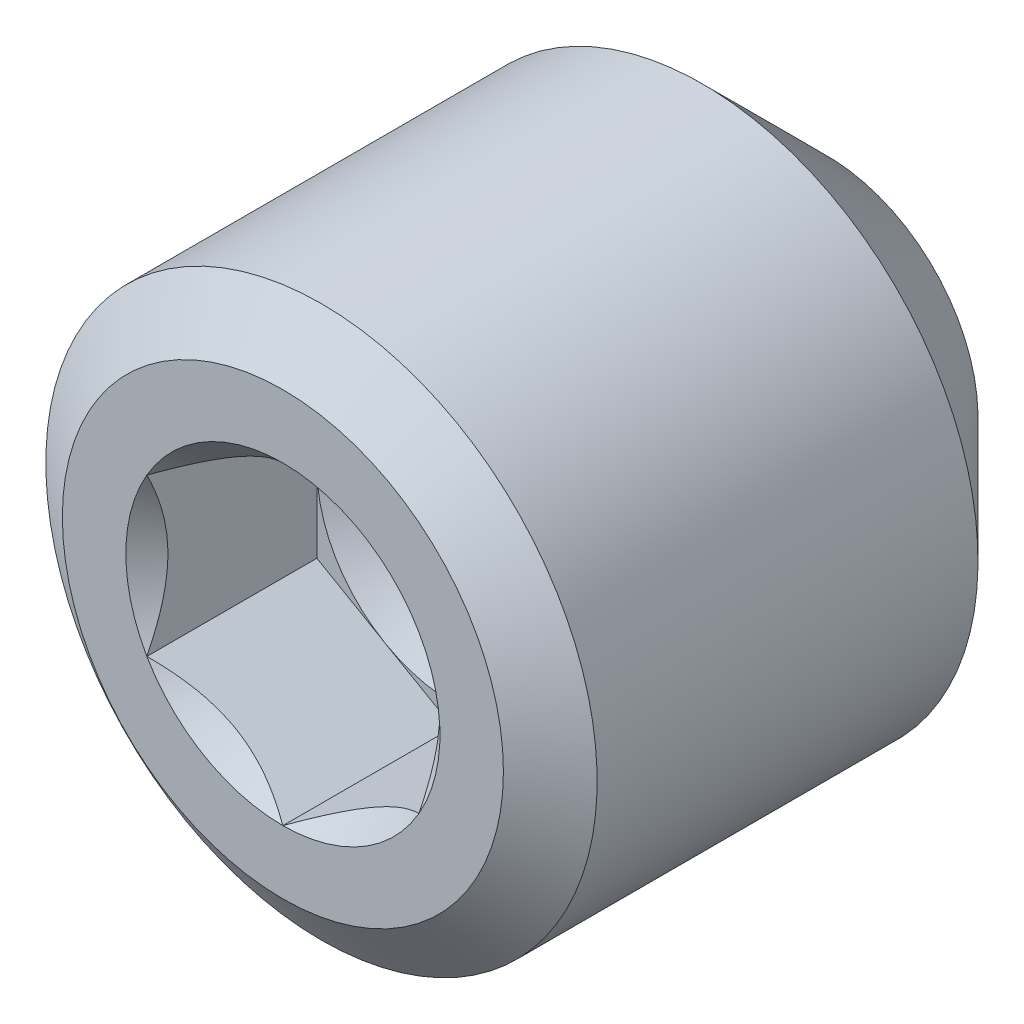
ISO-10303-21;
HEADER;
FILE_DESCRIPTION(('STEP AP214'),'2;1');
FILE_NAME('part.step','',(''),(''),'','','');
FILE_SCHEMA(('AUTOMOTIVE_DESIGN { 1 0 10303 214 1 1 1 1 }'));
ENDSEC;
DATA;
#1=APPLICATION_CONTEXT('core data for automotive mechanical design processes');
#2=APPLICATION_PROTOCOL_DEFINITION('international standard','automotive_design',2000,#1);
#3=PRODUCT_CONTEXT('',#1,'mechanical');
#4=PRODUCT('Part','Part','',(#3));
#5=PRODUCT_RELATED_PRODUCT_CATEGORY('part','',(#4));
#6=PRODUCT_DEFINITION_FORMATION('','',#4);
#7=PRODUCT_DEFINITION_CONTEXT('part definition',#1,'design');
#8=PRODUCT_DEFINITION('design','',#6,#7);
#9=PRODUCT_DEFINITION_SHAPE('','',#8);
#10=(LENGTH_UNIT() NAMED_UNIT(*) SI_UNIT(.MILLI.,.METRE.));
#11=(NAMED_UNIT(*) PLANE_ANGLE_UNIT() SI_UNIT($,.RADIAN.));
#12=(NAMED_UNIT(*) SI_UNIT($,.STERADIAN.) SOLID_ANGLE_UNIT());
#13=UNCERTAINTY_MEASURE_WITH_UNIT(LENGTH_MEASURE(1.E-05),#10,'distance_accuracy_value','');
#14=(GEOMETRIC_REPRESENTATION_CONTEXT(3) GLOBAL_UNCERTAINTY_ASSIGNED_CONTEXT((#13)) GLOBAL_UNIT_ASSIGNED_CONTEXT((#10,
#11,#12)) REPRESENTATION_CONTEXT('',''));
#15=CARTESIAN_POINT('',(0.,0.,0.));
#16=DIRECTION('',(0.,0.,1.));
#17=DIRECTION('',(1.,0.,0.));
#18=AXIS2_PLACEMENT_3D('',#15,#16,#17);
#19=CARTESIAN_POINT('',(0.,0.,0.495727982126937));
#20=DIRECTION('',(0.,0.,1.));
#21=DIRECTION('',(0.,-1.,0.));
#22=AXIS2_PLACEMENT_3D('',#19,#20,#21);
#23=CONICAL_SURFACE('',#22,1.19062499987876,1.04719755103086);
#24=CARTESIAN_POINT('',(2.55795384873636E-10,0.,-0.19167968210354));
#25=VERTEX_POINT('',#24);
#26=VERTEX_LOOP('',#25);
#27=FACE_BOUND('',#26,.T.);
#28=CARTESIAN_POINT('',(0.,0.,0.495727982192574));
#29=DIRECTION('',(0.,0.,1.));
#30=DIRECTION('',(0.,-1.,0.));
#31=AXIS2_PLACEMENT_3D('',#28,#29,#30);
#32=CIRCLE('',#31,1.19062499999245);
#33=CARTESIAN_POINT('',(1.19062499999623,0.,0.495727982183542));
#34=VERTEX_POINT('',#33);
#35=CARTESIAN_POINT('',(0.595312499998112,-1.03111149637757,0.495727982183542));
#36=VERTEX_POINT('',#35);
#37=EDGE_CURVE('E101',#34,#36,#32,.F.);
#38=ORIENTED_EDGE('',*,*,#37,.F.);
#39=CARTESIAN_POINT('',(0.,0.,0.495727982192574));
#40=DIRECTION('',(0.,0.,1.));
#41=DIRECTION('',(0.,-1.,0.));
#42=AXIS2_PLACEMENT_3D('',#39,#40,#41);
#43=CIRCLE('',#42,1.19062499999245);
#44=CARTESIAN_POINT('',(0.59531249999812,1.03111149637759,0.495727982183542));
#45=VERTEX_POINT('',#44);
#46=EDGE_CURVE('E115',#45,#34,#43,.F.);
#47=ORIENTED_EDGE('',*,*,#46,.F.);
#48=CARTESIAN_POINT('',(0.,0.,0.495727982192574));
#49=DIRECTION('',(0.,0.,1.));
#50=DIRECTION('',(0.,-1.,0.));
#51=AXIS2_PLACEMENT_3D('',#48,#49,#50);
#52=CIRCLE('',#51,1.19062499999245);
#53=CARTESIAN_POINT('',(-0.595312499998102,1.0311114963776,0.495727982183538));
#54=VERTEX_POINT('',#53);
#55=EDGE_CURVE('E253',#54,#45,#52,.F.);
#56=ORIENTED_EDGE('',*,*,#55,.F.);
#57=CARTESIAN_POINT('',(0.,0.,0.495727982192574));
#58=DIRECTION('',(0.,0.,1.));
#59=DIRECTION('',(0.,-1.,0.));
#60=AXIS2_PLACEMENT_3D('',#57,#58,#59);
#61=CIRCLE('',#60,1.19062499999245);
#62=CARTESIAN_POINT('',(-1.19062499999622,1.30013777685213E-13,0.495727982183538));
#63=VERTEX_POINT('',#62);
#64=EDGE_CURVE('E152',#63,#54,#61,.F.);
#65=ORIENTED_EDGE('',*,*,#64,.F.);
#66=CARTESIAN_POINT('',(0.,0.,0.495727982192574));
#67=DIRECTION('',(0.,0.,1.));
#68=DIRECTION('',(0.,-1.,0.));
#69=AXIS2_PLACEMENT_3D('',#66,#67,#68);
#70=CIRCLE('',#69,1.19062499999245);
#71=CARTESIAN_POINT('',(-0.595312499998087,-1.03111149637758,0.495727982183542));
#72=VERTEX_POINT('',#71);
#73=EDGE_CURVE('E20',#72,#63,#70,.F.);
#74=ORIENTED_EDGE('',*,*,#73,.F.);
#75=CARTESIAN_POINT('',(0.,0.,0.495727982192574));
#76=DIRECTION('',(0.,0.,1.));
#77=DIRECTION('',(0.,-1.,0.));
#78=AXIS2_PLACEMENT_3D('',#75,#76,#77);
#79=CIRCLE('',#78,1.19062499999245);
#80=EDGE_CURVE('E373',#36,#72,#79,.F.);
#81=ORIENTED_EDGE('',*,*,#80,.F.);
#82=EDGE_LOOP('',(#38,#47,#56,#65,#74,#81));
#83=FACE_BOUND('',#82,.T.);
#84=ADVANCED_FACE('F17',(#27,#83),#23,.F.);
#85=CARTESIAN_POINT('',(-1.190625,2.06222299276171,0.49572798217451));
#86=DIRECTION('',(0.,0.,1.));
#87=DIRECTION('',(0.,-1.,0.));
#88=AXIS2_PLACEMENT_3D('',#85,#86,#87);
#89=PLANE('',#88);
#90=DIRECTION('',(0.,-1.,0.));
#91=VECTOR('',#90,1.);
#92=CARTESIAN_POINT('',(-1.190625,0.687407664253913,0.49572798217451));
#93=LINE('',#92,#91);
#94=CARTESIAN_POINT('',(-1.19062500000001,-0.687407664253882,0.49572798217451));
#95=VERTEX_POINT('',#94);
#96=EDGE_CURVE('E84',#63,#95,#93,.T.);
#97=ORIENTED_EDGE('',*,*,#96,.T.);
#98=DIRECTION('',(0.866025403784438,-0.500000000000001,0.));
#99=VECTOR('',#98,1.);
#100=CARTESIAN_POINT('',(-1.190625,-0.687407664253889,0.49572798217451));
#101=LINE('',#100,#99);
#102=EDGE_CURVE('E168',#95,#72,#101,.T.);
#103=ORIENTED_EDGE('',*,*,#102,.T.);
#104=ORIENTED_EDGE('',*,*,#73,.T.);
#105=EDGE_LOOP('',(#97,#103,#104));
#106=FACE_BOUND('',#105,.T.);
#107=ADVANCED_FACE('F270',(#106),#89,.T.);
#108=CARTESIAN_POINT('',(-1.190625,2.06222299276171,0.49572798217451));
#109=DIRECTION('',(0.,0.,1.));
#110=DIRECTION('',(0.,-1.,0.));
#111=AXIS2_PLACEMENT_3D('',#108,#109,#110);
#112=PLANE('',#111);
#113=DIRECTION('',(0.866025403784438,-0.500000000000001,0.));
#114=VECTOR('',#113,1.);
#115=CARTESIAN_POINT('',(-1.190625,-0.687407664253889,0.495727982174503));
#116=LINE('',#115,#114);
#117=CARTESIAN_POINT('',(0.,-1.37481532850779,0.495727982174507));
#118=VERTEX_POINT('',#117);
#119=EDGE_CURVE('E134',#72,#118,#116,.T.);
#120=ORIENTED_EDGE('',*,*,#119,.T.);
#121=DIRECTION('',(0.866025403784439,0.5,0.));
#122=VECTOR('',#121,1.);
#123=CARTESIAN_POINT('',(0.,-1.37481532850779,0.49572798217451));
#124=LINE('',#123,#122);
#125=EDGE_CURVE('E106',#118,#36,#124,.T.);
#126=ORIENTED_EDGE('',*,*,#125,.T.);
#127=ORIENTED_EDGE('',*,*,#80,.T.);
#128=EDGE_LOOP('',(#120,#126,#127));
#129=FACE_BOUND('',#128,.T.);
#130=ADVANCED_FACE('F268',(#129),#112,.T.);
#131=CARTESIAN_POINT('',(-1.190625,2.06222299276171,0.49572798217451));
#132=DIRECTION('',(0.,0.,1.));
#133=DIRECTION('',(0.,-1.,0.));
#134=AXIS2_PLACEMENT_3D('',#131,#132,#133);
#135=PLANE('',#134);
#136=DIRECTION('',(0.866025403784439,0.5,0.));
#137=VECTOR('',#136,1.);
#138=CARTESIAN_POINT('',(0.,-1.37481532850779,0.49572798217451));
#139=LINE('',#138,#137);
#140=CARTESIAN_POINT('',(1.19062500000001,-0.687407664253884,0.49572798217451));
#141=VERTEX_POINT('',#140);
#142=EDGE_CURVE('E96',#36,#141,#139,.T.);
#143=ORIENTED_EDGE('',*,*,#142,.T.);
#144=DIRECTION('',(0.,1.,0.));
#145=VECTOR('',#144,1.);
#146=CARTESIAN_POINT('',(1.19062500000001,-0.687407664253889,0.49572798217451));
#147=LINE('',#146,#145);
#148=EDGE_CURVE('E99',#141,#34,#147,.T.);
#149=ORIENTED_EDGE('',*,*,#148,.T.);
#150=ORIENTED_EDGE('',*,*,#37,.T.);
#151=EDGE_LOOP('',(#143,#149,#150));
#152=FACE_BOUND('',#151,.T.);
#153=ADVANCED_FACE('F98',(#152),#135,.T.);
#154=CARTESIAN_POINT('',(-1.190625,2.06222299276171,0.49572798217451));
#155=DIRECTION('',(0.,0.,1.));
#156=DIRECTION('',(0.,-1.,0.));
#157=AXIS2_PLACEMENT_3D('',#154,#155,#156);
#158=PLANE('',#157);
#159=DIRECTION('',(0.,1.,0.));
#160=VECTOR('',#159,1.);
#161=CARTESIAN_POINT('',(1.19062500000001,-0.687407664253889,0.495727982174509));
#162=LINE('',#161,#160);
#163=CARTESIAN_POINT('',(1.19062500000003,0.687407664253898,0.495727982174509));
#164=VERTEX_POINT('',#163);
#165=EDGE_CURVE('E114',#34,#164,#162,.T.);
#166=ORIENTED_EDGE('',*,*,#165,.T.);
#167=DIRECTION('',(-0.866025403784438,0.500000000000001,0.));
#168=VECTOR('',#167,1.);
#169=CARTESIAN_POINT('',(1.19062500000001,0.687407664253913,0.49572798217451));
#170=LINE('',#169,#168);
#171=EDGE_CURVE('E125',#164,#45,#170,.T.);
#172=ORIENTED_EDGE('',*,*,#171,.T.);
#173=ORIENTED_EDGE('',*,*,#46,.T.);
#174=EDGE_LOOP('',(#166,#172,#173));
#175=FACE_BOUND('',#174,.T.);
#176=ADVANCED_FACE('F261',(#175),#158,.T.);
#177=CARTESIAN_POINT('',(1.19062500000001,-0.687407664253889,0.49572798217451));
#178=DIRECTION('',(1.,0.,0.));
#179=DIRECTION('',(0.,1.,0.));
#180=AXIS2_PLACEMENT_3D('',#177,#178,#179);
#181=PLANE('',#180);
#182=CARTESIAN_POINT('',(1.19062499999567,0.687407664292412,1.98400923211493));
#183=CARTESIAN_POINT('',(1.19062499999845,0.64046328207789,1.96055894231477));
#184=CARTESIAN_POINT('',(1.19062499999959,0.592738991388445,1.9384779182468));
#185=CARTESIAN_POINT('',(1.19062500000044,0.495406225216116,1.89800295513959));
#186=CARTESIAN_POINT('',(1.19062500000013,0.44578762950972,1.87963356850329));
#187=CARTESIAN_POINT('',(1.1906249999999,0.345116375712698,1.84791358583569));
#188=CARTESIAN_POINT('',(1.19062499999999,0.294069215443057,1.83454600462254));
#189=CARTESIAN_POINT('',(1.19062500000004,0.190855854638069,1.81396603547193));
#190=CARTESIAN_POINT('',(1.19062500000002,0.138693632939681,1.80673461351588));
#191=CARTESIAN_POINT('',(1.19062500000001,0.0719511128628457,1.80190389372895));
#192=CARTESIAN_POINT('',(1.19062500000001,0.0575681065477679,1.80112291749238));
#193=CARTESIAN_POINT('',(1.19062500000001,0.0287907386471924,1.80008032792779));
#194=CARTESIAN_POINT('',(1.19062500000001,0.0143963874866042,1.79981843246661));
#195=CARTESIAN_POINT('',(1.19062500000001,-0.0361321030513867,1.79982008619966));
#196=CARTESIAN_POINT('',(1.19062500000001,-0.0722770331511759,1.80147394594884));
#197=CARTESIAN_POINT('',(1.19062500000001,-0.144284982609329,1.80799116289963));
#198=CARTESIAN_POINT('',(1.19062500000001,-0.180147787674807,1.81285675864882));
#199=CARTESIAN_POINT('',(1.19062500000001,-0.287258251714067,1.83196696983393));
#200=CARTESIAN_POINT('',(1.19062500000001,-0.35772529740189,1.85072176782421));
#201=CARTESIAN_POINT('',(1.19062500000001,-0.471552892507442,1.88908925370762));
#202=CARTESIAN_POINT('',(1.19062500000001,-0.515840765958847,1.90614997876308));
#203=CARTESIAN_POINT('',(1.19062500000001,-0.602739573147029,1.94312607455083));
#204=CARTESIAN_POINT('',(1.19062500000001,-0.645362139970547,1.96301390794479));
#205=CARTESIAN_POINT('',(1.19062500000001,-0.687407664293118,1.98400923211292));
#206=B_SPLINE_CURVE_WITH_KNOTS('',3,(#182,#183,#184,#185,#186,#187,#188,#189,#190,#191,#192,
#193,#194,#195,#196,#197,#198,#199,#200,#201,#202,#203,#204,#205),.UNSPECIFIED.,.F.,.F.,(4,2,2,
2,2,2,2,2,2,2,2,4),(0.,0.157535403142992,0.316081041540045,0.474083294698365,0.631593623243647,
0.674799715139207,0.717982317014592,0.826362160391399,0.934817623300469,1.15262451060987,
1.29491478060776,1.43590359051227),.UNSPECIFIED.);
#207=CARTESIAN_POINT('',(1.19062500005789,0.687407664240221,1.98400923213658));
#208=VERTEX_POINT('',#207);
#209=CARTESIAN_POINT('',(1.19062500002894,-0.687407664270611,1.98400923212671));
#210=VERTEX_POINT('',#209);
#211=EDGE_CURVE('E160',#208,#210,#206,.T.);
#212=ORIENTED_EDGE('',*,*,#211,.F.);
#213=DIRECTION('',(0.,0.,1.));
#214=VECTOR('',#213,1.);
#215=CARTESIAN_POINT('',(1.19062500000003,0.687407664253898,0.49572798217451));
#216=LINE('',#215,#214);
#217=EDGE_CURVE('E140',#208,#164,#216,.F.);
#218=ORIENTED_EDGE('',*,*,#217,.T.);
#219=ORIENTED_EDGE('',*,*,#165,.F.);
#220=ORIENTED_EDGE('',*,*,#148,.F.);
#221=DIRECTION('',(0.,0.,1.));
#222=VECTOR('',#221,1.);
#223=CARTESIAN_POINT('',(1.19062500000001,-0.687407664253884,0.49572798217451));
#224=LINE('',#223,#222);
#225=EDGE_CURVE('E105',#141,#210,#224,.T.);
#226=ORIENTED_EDGE('',*,*,#225,.T.);
#227=EDGE_LOOP('',(#212,#218,#219,#220,#226));
#228=FACE_BOUND('',#227,.T.);
#229=ADVANCED_FACE('F111',(#228),#181,.F.);
#230=CARTESIAN_POINT('',(-1.190625,2.06222299276171,0.49572798217451));
#231=DIRECTION('',(0.,0.,1.));
#232=DIRECTION('',(0.,-1.,0.));
#233=AXIS2_PLACEMENT_3D('',#230,#231,#232);
#234=PLANE('',#233);
#235=DIRECTION('',(-0.866025403784438,0.500000000000001,0.));
#236=VECTOR('',#235,1.);
#237=CARTESIAN_POINT('',(1.19062500000001,0.687407664253913,0.495727982174503));
#238=LINE('',#237,#236);
#239=CARTESIAN_POINT('',(0.,1.37481532850782,0.495727982174503));
#240=VERTEX_POINT('',#239);
#241=EDGE_CURVE('E137',#45,#240,#238,.T.);
#242=ORIENTED_EDGE('',*,*,#241,.T.);
#243=DIRECTION('',(-0.866025403784439,-0.5,0.));
#244=VECTOR('',#243,1.);
#245=CARTESIAN_POINT('',(0.,1.37481532850781,0.495727982174503));
#246=LINE('',#245,#244);
#247=EDGE_CURVE('E143',#240,#54,#246,.T.);
#248=ORIENTED_EDGE('',*,*,#247,.T.);
#249=ORIENTED_EDGE('',*,*,#55,.T.);
#250=EDGE_LOOP('',(#242,#248,#249));
#251=FACE_BOUND('',#250,.T.);
#252=ADVANCED_FACE('F260',(#251),#234,.T.);
#253=CARTESIAN_POINT('',(-1.190625,2.06222299276171,0.49572798217451));
#254=DIRECTION('',(0.,0.,1.));
#255=DIRECTION('',(0.,-1.,0.));
#256=AXIS2_PLACEMENT_3D('',#253,#254,#255);
#257=PLANE('',#256);
#258=DIRECTION('',(-0.866025403784439,-0.5,0.));
#259=VECTOR('',#258,1.);
#260=CARTESIAN_POINT('',(0.,1.37481532850781,0.495727982174501));
#261=LINE('',#260,#259);
#262=CARTESIAN_POINT('',(-1.190625,0.687407664253916,0.495727982174502));
#263=VERTEX_POINT('',#262);
#264=EDGE_CURVE('E146',#54,#263,#261,.T.);
#265=ORIENTED_EDGE('',*,*,#264,.T.);
#266=DIRECTION('',(0.,-1.,0.));
#267=VECTOR('',#266,1.);
#268=CARTESIAN_POINT('',(-1.190625,0.687407664253913,0.495727982174503));
#269=LINE('',#268,#267);
#270=EDGE_CURVE('E149',#263,#63,#269,.T.);
#271=ORIENTED_EDGE('',*,*,#270,.T.);
#272=ORIENTED_EDGE('',*,*,#64,.T.);
#273=EDGE_LOOP('',(#265,#271,#272));
#274=FACE_BOUND('',#273,.T.);
#275=ADVANCED_FACE('F359',(#274),#257,.T.);
#276=CARTESIAN_POINT('',(-1.190625,0.687407664253913,0.495727982174503));
#277=DIRECTION('',(-1.,0.,0.));
#278=DIRECTION('',(0.,-1.,0.));
#279=AXIS2_PLACEMENT_3D('',#276,#277,#278);
#280=PLANE('',#279);
#281=CARTESIAN_POINT('',(-1.19062499999689,0.687407664295069,1.98400923211557));
#282=CARTESIAN_POINT('',(-1.19062499999888,0.640154592187732,1.96040536744382));
#283=CARTESIAN_POINT('',(-1.1906249999997,0.592111444465279,1.93818802847305));
#284=CARTESIAN_POINT('',(-1.1906250000003,0.494146535985991,1.89750902941694));
#285=CARTESIAN_POINT('',(-1.19062500000008,0.444215463852093,1.87906999571823));
#286=CARTESIAN_POINT('',(-1.19062499999992,0.34353191261821,1.84748380274731));
#287=CARTESIAN_POINT('',(-1.19062499999998,0.292805060660136,1.83425727427473));
#288=CARTESIAN_POINT('',(-1.19062500000002,0.19023488957445,1.81387930355028));
#289=CARTESIAN_POINT('',(-1.190625,0.138394701629495,1.80671265556526));
#290=CARTESIAN_POINT('',(-1.19062499999999,0.0490434171471756,1.80024610055994));
#291=CARTESIAN_POINT('',(-1.190625,0.0116476312291625,1.79928918177737));
#292=CARTESIAN_POINT('',(-1.190625,-0.0630781169061416,1.80090396128143));
#293=CARTESIAN_POINT('',(-1.190625,-0.100408062759505,1.80347643902957));
#294=CARTESIAN_POINT('',(-1.190625,-0.174707550763351,1.81200130363095));
#295=CARTESIAN_POINT('',(-1.190625,-0.211676725216807,1.81795683341918));
#296=CARTESIAN_POINT('',(-1.190625,-0.284997830944034,1.83292705321312));
#297=CARTESIAN_POINT('',(-1.190625,-0.321349490320898,1.84194305589422));
#298=CARTESIAN_POINT('',(-1.190625,-0.414409407701737,1.86868846791361));
#299=CARTESIAN_POINT('',(-1.190625,-0.47053205911329,1.88842523325998));
#300=CARTESIAN_POINT('',(-1.190625,-0.580581647456373,1.93288237138799));
#301=CARTESIAN_POINT('',(-1.190625,-0.634515062273283,1.95758652132262));
#302=CARTESIAN_POINT('',(-1.190625,-0.687407664295433,1.98400923211406));
#303=B_SPLINE_CURVE_WITH_KNOTS('',3,(#281,#282,#283,#284,#285,#286,#287,#288,#289,#290,#291,
#292,#293,#294,#295,#296,#297,#298,#299,#300,#301,#302),.UNSPECIFIED.,.F.,.F.,(4,2,2,2,2,2,2,2,
2,2,4),(0.,0.158570945782174,0.318065397827539,0.475027617267219,0.631594801071171,
0.743660160759135,0.855750273884749,0.967944692071428,1.08018729279008,1.25836291045195,
1.43596581394394),.UNSPECIFIED.);
#304=CARTESIAN_POINT('',(-1.19062500002893,0.687407664270642,1.98400923212671));
#305=VERTEX_POINT('',#304);
#306=CARTESIAN_POINT('',(-1.19062500005789,-0.687407664241365,1.98400923213716));
#307=VERTEX_POINT('',#306);
#308=EDGE_CURVE('E314',#305,#307,#303,.T.);
#309=ORIENTED_EDGE('',*,*,#308,.T.);
#310=DIRECTION('',(0.,0.,1.));
#311=VECTOR('',#310,1.);
#312=CARTESIAN_POINT('',(-1.19062500000001,-0.687407664253882,0.49572798217451));
#313=LINE('',#312,#311);
#314=EDGE_CURVE('E132',#307,#95,#313,.F.);
#315=ORIENTED_EDGE('',*,*,#314,.T.);
#316=ORIENTED_EDGE('',*,*,#96,.F.);
#317=ORIENTED_EDGE('',*,*,#270,.F.);
#318=DIRECTION('',(0.,0.,1.));
#319=VECTOR('',#318,1.);
#320=CARTESIAN_POINT('',(-1.190625,0.687407664253916,0.495727982174503));
#321=LINE('',#320,#319);
#322=EDGE_CURVE('E156',#263,#305,#321,.T.);
#323=ORIENTED_EDGE('',*,*,#322,.T.);
#324=EDGE_LOOP('',(#309,#315,#316,#317,#323));
#325=FACE_BOUND('',#324,.T.);
#326=ADVANCED_FACE('F331',(#325),#280,.F.);
#327=CARTESIAN_POINT('',(-1.190625,-0.687407664253889,0.49572798217451));
#328=DIRECTION('',(-0.500000000000001,-0.866025403784438,0.));
#329=DIRECTION('',(0.866025403784438,-0.500000000000001,0.));
#330=AXIS2_PLACEMENT_3D('',#327,#328,#329);
#331=PLANE('',#330);
#332=CARTESIAN_POINT('',(-1.19062500003409,-0.687407664230629,1.98400923211556));
#333=CARTESIAN_POINT('',(-1.14970263918327,-0.711034200286016,1.96040536744382));
#334=CARTESIAN_POINT('',(-1.10809605277826,-0.73505577414795,1.93818802847304));
#335=CARTESIAN_POINT('',(-1.02325595335608,-0.784038228388114,1.89750902941694));
#336=CARTESIAN_POINT('',(-0.980014376449825,-0.809003764454871,1.87906999571824));
#337=CARTESIAN_POINT('',(-0.892819863337972,-0.859345540071674,1.84748380274731));
#338=CARTESIAN_POINT('',(-0.848889120888296,-0.884708966050761,1.83425727427474));
#339=CARTESIAN_POINT('',(-0.760060747057598,-0.93599405159364,1.81387930355029));
#340=CARTESIAN_POINT('',(-0.7151658273603,-0.961914145566103,1.80671265556527));
#341=CARTESIAN_POINT('',(-0.637785345137838,-1.00658978780726,1.80024610055994));
#342=CARTESIAN_POINT('',(-0.605399644538355,-1.02528768076626,1.79928918177737));
#343=CARTESIAN_POINT('',(-0.540685248336385,-1.06265055483392,1.80090396128143));
#344=CARTESIAN_POINT('',(-0.508356566905474,-1.0813155277606,1.80347643902958));
#345=CARTESIAN_POINT('',(-0.444011322805966,-1.11846527176252,1.81200130363096));
#346=CARTESIAN_POINT('',(-0.411995078572333,-1.13694985898925,1.81795683341919));
#347=CARTESIAN_POINT('',(-0.348497138378991,-1.17361041185286,1.83292705321313));
#348=CARTESIAN_POINT('',(-0.317015677888907,-1.1917862415413,1.84194305589423));
#349=CARTESIAN_POINT('',(-0.23642342536302,-1.23831620023172,1.86868846791362));
#350=CARTESIAN_POINT('',(-0.187819783512878,-1.26637752593749,1.88842523325998));
#351=CARTESIAN_POINT('',(-0.0925140443317499,-1.32140232010903,1.932882371388));
#352=CARTESIAN_POINT('',(-0.0458063369874632,-1.34836902751749,1.95758652132262));
#353=CARTESIAN_POINT('',(3.59776575595635E-11,-1.37481532852856,1.98400923211406));
#354=B_SPLINE_CURVE_WITH_KNOTS('',3,(#332,#333,#334,#335,#336,#337,#338,#339,#340,#341,#342,
#343,#344,#345,#346,#347,#348,#349,#350,#351,#352,#353),.UNSPECIFIED.,.F.,.F.,(4,2,2,2,2,2,2,2,
2,2,4),(0.,0.158570945782172,0.318065397827535,0.475027617267213,0.631594801071163,
0.743660160759127,0.855750273884742,0.967944692071422,1.08018729279007,1.25836291045194,
1.43596581394393),.UNSPECIFIED.);
#355=CARTESIAN_POINT('',(-3.97893440011964E-11,-1.37481532855166,1.98400923213716));
#356=VERTEX_POINT('',#355);
#357=EDGE_CURVE('E319',#307,#356,#354,.T.);
#358=ORIENTED_EDGE('',*,*,#357,.T.);
#359=DIRECTION('',(0.,0.,1.));
#360=VECTOR('',#359,1.);
#361=CARTESIAN_POINT('',(0.,-1.3748153285078,0.49572798217451));
#362=LINE('',#361,#360);
#363=EDGE_CURVE('E122',#356,#118,#362,.F.);
#364=ORIENTED_EDGE('',*,*,#363,.T.);
#365=ORIENTED_EDGE('',*,*,#119,.F.);
#366=ORIENTED_EDGE('',*,*,#102,.F.);
#367=ORIENTED_EDGE('',*,*,#314,.F.);
#368=EDGE_LOOP('',(#358,#364,#365,#366,#367));
#369=FACE_BOUND('',#368,.T.);
#370=ADVANCED_FACE('F352',(#369),#331,.F.);
#371=CARTESIAN_POINT('',(0.,-1.37481532850779,0.49572798217451));
#372=DIRECTION('',(0.5,-0.866025403784439,0.));
#373=DIRECTION('',(0.866025403784439,0.5,0.));
#374=AXIS2_PLACEMENT_3D('',#371,#372,#373);
#375=PLANE('',#374);
#376=CARTESIAN_POINT('',(-3.7187299035962E-11,-1.37481532852568,1.98400923211557));
#377=CARTESIAN_POINT('',(0.0409223608156151,-1.35118879247373,1.96040536744382));
#378=CARTESIAN_POINT('',(0.0825289472214342,-1.32716721861321,1.93818802847305));
#379=CARTESIAN_POINT('',(0.167369046644212,-1.27818476437409,1.89750902941694));
#380=CARTESIAN_POINT('',(0.210610623550247,-1.25321922830695,1.87906999571824));
#381=CARTESIAN_POINT('',(0.297805136661942,-1.20287745268987,1.84748380274731));
#382=CARTESIAN_POINT('',(0.341735879111678,-1.17751402671088,1.83425727427474));
#383=CARTESIAN_POINT('',(0.430564252942422,-1.12622894116808,1.81387930355029));
#384=CARTESIAN_POINT('',(0.475459172639706,-1.10030884719558,1.80671265556527));
#385=CARTESIAN_POINT('',(0.552839654862164,-1.05563320495441,1.80024610055994));
#386=CARTESIAN_POINT('',(0.58522535546165,-1.03693531199541,1.79928918177737));
#387=CARTESIAN_POINT('',(0.649939751663623,-0.999572437927758,1.80090396128143));
#388=CARTESIAN_POINT('',(0.682268433094534,-0.980907465001075,1.80347643902958));
#389=CARTESIAN_POINT('',(0.746613677194042,-0.943757720999152,1.81200130363096));
#390=CARTESIAN_POINT('',(0.778629921427674,-0.925273133772424,1.81795683341919));
#391=CARTESIAN_POINT('',(0.842127861621015,-0.888612580908812,1.83292705321313));
#392=CARTESIAN_POINT('',(0.873609322111098,-0.87043675122038,1.84194305589423));
#393=CARTESIAN_POINT('',(0.954201574636604,-0.82390679253018,1.86868846791349));
#394=CARTESIAN_POINT('',(1.00280521648638,-0.795845466824616,1.88842523325968));
#395=CARTESIAN_POINT('',(1.0981109556668,-0.740820672653482,1.93288237138728));
#396=CARTESIAN_POINT('',(1.14481866301075,-0.713853965245223,1.95758652132166));
#397=CARTESIAN_POINT('',(1.19062500003387,-0.687407664234335,1.98400923211284));
#398=B_SPLINE_CURVE_WITH_KNOTS('',3,(#376,#377,#378,#379,#380,#381,#382,#383,#384,#385,#386,
#387,#388,#389,#390,#391,#392,#393,#394,#395,#396,#397),.UNSPECIFIED.,.F.,.F.,(4,2,2,2,2,2,2,2,
2,2,4),(0.,0.158570945782166,0.318065397827523,0.475027617267209,0.631594801071167,
0.743660160759134,0.855750273884751,0.967944692071429,1.08018729279008,1.25836291045058,
1.43596581394121),.UNSPECIFIED.);
#399=EDGE_CURVE('E120',#356,#210,#398,.T.);
#400=ORIENTED_EDGE('',*,*,#399,.T.);
#401=ORIENTED_EDGE('',*,*,#225,.F.);
#402=ORIENTED_EDGE('',*,*,#142,.F.);
#403=ORIENTED_EDGE('',*,*,#125,.F.);
#404=ORIENTED_EDGE('',*,*,#363,.F.);
#405=EDGE_LOOP('',(#400,#401,#402,#403,#404));
#406=FACE_BOUND('',#405,.T.);
#407=ADVANCED_FACE('F117',(#406),#375,.F.);
#408=CARTESIAN_POINT('',(1.19062500000001,0.687407664253913,0.49572798217451));
#409=DIRECTION('',(0.500000000000001,0.866025403784438,0.));
#410=DIRECTION('',(-0.866025403784438,0.500000000000001,0.));
#411=AXIS2_PLACEMENT_3D('',#408,#409,#410);
#412=PLANE('',#411);
#413=CARTESIAN_POINT('',(1.19062500003121,0.687407664230863,1.98400923211496));
#414=CARTESIAN_POINT('',(1.14970263918109,0.711034200286776,1.96040536744301));
#415=CARTESIAN_POINT('',(1.10809605277648,0.735055774148869,1.93818802847223));
#416=CARTESIAN_POINT('',(1.02325595335481,0.784038228389021,1.89750902941629));
#417=CARTESIAN_POINT('',(0.98001437644867,0.809003764455603,1.87906999571776));
#418=CARTESIAN_POINT('',(0.892819863337155,0.859345540072137,1.84748380274708));
#419=CARTESIAN_POINT('',(0.848889120887694,0.884708966051127,1.83425727427459));
#420=CARTESIAN_POINT('',(0.760060747057411,0.935994051593785,1.81387930355026));
#421=CARTESIAN_POINT('',(0.715165827360314,0.961914145566125,1.80671265556529));
#422=CARTESIAN_POINT('',(0.637785345138079,1.00658978780714,1.80024610055996));
#423=CARTESIAN_POINT('',(0.605399644538619,1.02528768076614,1.79928918177738));
#424=CARTESIAN_POINT('',(0.540685248336694,1.06265055483377,1.80090396128142));
#425=CARTESIAN_POINT('',(0.508356566905804,1.08131552776044,1.80347643902955));
#426=CARTESIAN_POINT('',(0.444011322806335,1.11846527176234,1.8120013036309));
#427=CARTESIAN_POINT('',(0.411995078572721,1.13694985898905,1.81795683341912));
#428=CARTESIAN_POINT('',(0.348497138379412,1.17361041185265,1.83292705321302));
#429=CARTESIAN_POINT('',(0.317015677889345,1.19178624154107,1.8419430558941));
#430=CARTESIAN_POINT('',(0.236423425363389,1.23831620023153,1.86868846791348));
#431=CARTESIAN_POINT('',(0.187819783513164,1.26637752593735,1.88842523325986));
#432=CARTESIAN_POINT('',(0.0925140443318827,1.32140232010898,1.93288237138793));
#433=CARTESIAN_POINT('',(0.0458063369875248,1.34836902751748,1.9575865213226));
#434=CARTESIAN_POINT('',(-3.59844204254258E-11,1.37481532852859,1.98400923211407));
#435=B_SPLINE_CURVE_WITH_KNOTS('',3,(#413,#414,#415,#416,#417,#418,#419,#420,#421,#422,#423,
#424,#425,#426,#427,#428,#429,#430,#431,#432,#433,#434),.UNSPECIFIED.,.F.,.F.,(4,2,2,2,2,2,2,2,
2,2,4),(0.,0.158570945781483,0.318065397826116,0.475027617265063,0.631594801068299,
0.743660160756186,0.855750273881723,0.967944692068335,1.08018729278692,1.25836291044907,
1.43596581394133),.UNSPECIFIED.);
#436=CARTESIAN_POINT('',(3.97830534634665E-11,1.37481532855168,1.98400923213717));
#437=VERTEX_POINT('',#436);
#438=EDGE_CURVE('E35',#208,#437,#435,.T.);
#439=ORIENTED_EDGE('',*,*,#438,.T.);
#440=DIRECTION('',(0.,0.,1.));
#441=VECTOR('',#440,1.);
#442=CARTESIAN_POINT('',(0.,1.37481532850782,0.495727982174503));
#443=LINE('',#442,#441);
#444=EDGE_CURVE('E312',#437,#240,#443,.F.);
#445=ORIENTED_EDGE('',*,*,#444,.T.);
#446=ORIENTED_EDGE('',*,*,#241,.F.);
#447=ORIENTED_EDGE('',*,*,#171,.F.);
#448=ORIENTED_EDGE('',*,*,#217,.F.);
#449=EDGE_LOOP('',(#439,#445,#446,#447,#448));
#450=FACE_BOUND('',#449,.T.);
#451=ADVANCED_FACE('F351',(#450),#412,.F.);
#452=CARTESIAN_POINT('',(0.,1.37481532850781,0.495727982174503));
#453=DIRECTION('',(-0.5,0.866025403784439,0.));
#454=DIRECTION('',(-0.866025403784439,-0.5,0.));
#455=AXIS2_PLACEMENT_3D('',#452,#453,#454);
#456=PLANE('',#455);
#457=CARTESIAN_POINT('',(3.7170576648238E-11,1.37481532852571,1.98400923211556));
#458=CARTESIAN_POINT('',(-0.0409223608156309,1.35118879247375,1.96040536744381));
#459=CARTESIAN_POINT('',(-0.0825289472214504,1.32716721861323,1.93818802847304));
#460=CARTESIAN_POINT('',(-0.16736904664423,1.2781847643741,1.89750902941694));
#461=CARTESIAN_POINT('',(-0.210610623550268,1.25321922830696,1.87906999571824));
#462=CARTESIAN_POINT('',(-0.297805136661962,1.20287745268989,1.84748380274731));
#463=CARTESIAN_POINT('',(-0.341735879111695,1.1775140267109,1.83425727427474));
#464=CARTESIAN_POINT('',(-0.430564252942434,1.12622894116809,1.81387930355029));
#465=CARTESIAN_POINT('',(-0.475459172639716,1.1003088471956,1.80671265556527));
#466=CARTESIAN_POINT('',(-0.552839654862171,1.05563320495443,1.80024610055995));
#467=CARTESIAN_POINT('',(-0.585225355461656,1.03693531199543,1.79928918177738));
#468=CARTESIAN_POINT('',(-0.649939751663629,0.999572437927779,1.80090396128144));
#469=CARTESIAN_POINT('',(-0.682268433094539,0.980907465001097,1.80347643902958));
#470=CARTESIAN_POINT('',(-0.746613677194047,0.943757720999173,1.81200130363096));
#471=CARTESIAN_POINT('',(-0.77862992142768,0.925273133772445,1.81795683341919));
#472=CARTESIAN_POINT('',(-0.842127861621023,0.888612580908832,1.83292705321314));
#473=CARTESIAN_POINT('',(-0.873609322111106,0.870436751220399,1.84194305589423));
#474=CARTESIAN_POINT('',(-0.954201574636989,0.823906792529982,1.86868846791362));
#475=CARTESIAN_POINT('',(-1.00280521648713,0.795845466824209,1.88842523325999));
#476=CARTESIAN_POINT('',(-1.09811095566825,0.740820672652673,1.932882371388));
#477=CARTESIAN_POINT('',(-1.14481866301253,0.713853965244221,1.95758652132262));
#478=CARTESIAN_POINT('',(-1.19062500003597,0.687407664233148,1.98400923211406));
#479=B_SPLINE_CURVE_WITH_KNOTS('',3,(#457,#458,#459,#460,#461,#462,#463,#464,#465,#466,#467,
#468,#469,#470,#471,#472,#473,#474,#475,#476,#477,#478),.UNSPECIFIED.,.F.,.F.,(4,2,2,2,2,2,2,2,
2,2,4),(0.,0.158570945782171,0.318065397827532,0.47502761726721,0.631594801071159,
0.743660160759124,0.855750273884739,0.967944692071419,1.08018729279007,1.25836291045192,
1.4359658139439),.UNSPECIFIED.);
#480=EDGE_CURVE('E208',#437,#305,#479,.T.);
#481=ORIENTED_EDGE('',*,*,#480,.T.);
#482=ORIENTED_EDGE('',*,*,#322,.F.);
#483=ORIENTED_EDGE('',*,*,#264,.F.);
#484=ORIENTED_EDGE('',*,*,#247,.F.);
#485=ORIENTED_EDGE('',*,*,#444,.F.);
#486=EDGE_LOOP('',(#481,#482,#483,#484,#485));
#487=FACE_BOUND('',#486,.T.);
#488=ADVANCED_FACE('F222',(#487),#456,.F.);
#489=CARTESIAN_POINT('',(0.,0.,1.98400923216013));
#490=DIRECTION('',(0.,0.,1.));
#491=DIRECTION('',(1.,0.,0.));
#492=AXIS2_PLACEMENT_3D('',#489,#490,#491);
#493=CONICAL_SURFACE('',#492,1.37481532857464,0.785398163397448);
#494=ORIENTED_EDGE('',*,*,#308,.F.);
#495=CARTESIAN_POINT('',(0.,0.,1.98400923216013));
#496=DIRECTION('',(0.,0.,1.));
#497=DIRECTION('',(1.,0.,0.));
#498=AXIS2_PLACEMENT_3D('',#495,#496,#497);
#499=CIRCLE('',#498,1.37481532857464);
#500=EDGE_CURVE('E205',#305,#307,#499,.T.);
#501=ORIENTED_EDGE('',*,*,#500,.T.);
#502=EDGE_LOOP('',(#494,#501));
#503=FACE_BOUND('',#502,.T.);
#504=ADVANCED_FACE('F315',(#503),#493,.F.);
#505=CARTESIAN_POINT('',(0.,0.,1.98400923216013));
#506=DIRECTION('',(0.,0.,1.));
#507=DIRECTION('',(1.,0.,0.));
#508=AXIS2_PLACEMENT_3D('',#505,#506,#507);
#509=CONICAL_SURFACE('',#508,1.37481532857464,0.785398163397448);
#510=ORIENTED_EDGE('',*,*,#357,.F.);
#511=CARTESIAN_POINT('',(0.,0.,1.98400923216013));
#512=DIRECTION('',(0.,0.,1.));
#513=DIRECTION('',(1.,0.,0.));
#514=AXIS2_PLACEMENT_3D('',#511,#512,#513);
#515=CIRCLE('',#514,1.37481532857464);
#516=EDGE_CURVE('E202',#307,#356,#515,.T.);
#517=ORIENTED_EDGE('',*,*,#516,.T.);
#518=EDGE_LOOP('',(#510,#517));
#519=FACE_BOUND('',#518,.T.);
#520=ADVANCED_FACE('F335',(#519),#509,.F.);
#521=CARTESIAN_POINT('',(0.,0.,1.98400923216013));
#522=DIRECTION('',(0.,0.,1.));
#523=DIRECTION('',(1.,0.,0.));
#524=AXIS2_PLACEMENT_3D('',#521,#522,#523);
#525=CONICAL_SURFACE('',#524,1.37481532857464,0.785398163397448);
#526=ORIENTED_EDGE('',*,*,#399,.F.);
#527=CARTESIAN_POINT('',(0.,0.,1.98400923216013));
#528=DIRECTION('',(0.,0.,1.));
#529=DIRECTION('',(1.,0.,0.));
#530=AXIS2_PLACEMENT_3D('',#527,#528,#529);
#531=CIRCLE('',#530,1.37481532857464);
#532=EDGE_CURVE('E200',#356,#210,#531,.T.);
#533=ORIENTED_EDGE('',*,*,#532,.T.);
#534=EDGE_LOOP('',(#526,#533));
#535=FACE_BOUND('',#534,.T.);
#536=ADVANCED_FACE('F241',(#535),#525,.F.);
#537=CARTESIAN_POINT('',(0.,0.,1.98400923216013));
#538=DIRECTION('',(0.,0.,1.));
#539=DIRECTION('',(1.,0.,0.));
#540=AXIS2_PLACEMENT_3D('',#537,#538,#539);
#541=CONICAL_SURFACE('',#540,1.37481532857464,0.785398163550834);
#542=CARTESIAN_POINT('',(0.,0.,1.98400923216013));
#543=DIRECTION('',(0.,0.,1.));
#544=DIRECTION('',(1.,0.,0.));
#545=AXIS2_PLACEMENT_3D('',#542,#543,#544);
#546=CIRCLE('',#545,1.37481532857464);
#547=EDGE_CURVE('E197',#210,#208,#546,.T.);
#548=ORIENTED_EDGE('',*,*,#547,.T.);
#549=ORIENTED_EDGE('',*,*,#211,.T.);
#550=EDGE_LOOP('',(#548,#549));
#551=FACE_BOUND('',#550,.T.);
#552=ADVANCED_FACE('F236',(#551),#541,.F.);
#553=CARTESIAN_POINT('',(0.,0.,1.98400923216013));
#554=DIRECTION('',(0.,0.,1.));
#555=DIRECTION('',(1.,0.,0.));
#556=AXIS2_PLACEMENT_3D('',#553,#554,#555);
#557=CONICAL_SURFACE('',#556,1.37481532857464,0.785398163397448);
#558=ORIENTED_EDGE('',*,*,#438,.F.);
#559=CARTESIAN_POINT('',(0.,0.,1.98400923216013));
#560=DIRECTION('',(0.,0.,1.));
#561=DIRECTION('',(1.,0.,0.));
#562=AXIS2_PLACEMENT_3D('',#559,#560,#561);
#563=CIRCLE('',#562,1.37481532857464);
#564=EDGE_CURVE('E194',#208,#437,#563,.T.);
#565=ORIENTED_EDGE('',*,*,#564,.T.);
#566=EDGE_LOOP('',(#558,#565));
#567=FACE_BOUND('',#566,.T.);
#568=ADVANCED_FACE('F230',(#567),#557,.F.);
#569=CARTESIAN_POINT('',(0.,0.,1.98400923216013));
#570=DIRECTION('',(0.,0.,1.));
#571=DIRECTION('',(1.,0.,0.));
#572=AXIS2_PLACEMENT_3D('',#569,#570,#571);
#573=CONICAL_SURFACE('',#572,1.37481532857464,0.785398163397448);
#574=ORIENTED_EDGE('',*,*,#480,.F.);
#575=CARTESIAN_POINT('',(0.,0.,1.98400923216013));
#576=DIRECTION('',(0.,0.,1.));
#577=DIRECTION('',(1.,0.,0.));
#578=AXIS2_PLACEMENT_3D('',#575,#576,#577);
#579=CIRCLE('',#578,1.37481532857464);
#580=EDGE_CURVE('E191',#437,#305,#579,.T.);
#581=ORIENTED_EDGE('',*,*,#580,.T.);
#582=EDGE_LOOP('',(#574,#581));
#583=FACE_BOUND('',#582,.T.);
#584=ADVANCED_FACE('F225',(#583),#573,.F.);
#585=CARTESIAN_POINT('',(0.,1.32223931889029,-2.77849076782551));
#586=DIRECTION('',(0.,0.,1.));
#587=DIRECTION('',(0.,-1.,0.));
#588=AXIS2_PLACEMENT_3D('',#585,#586,#587);
#589=PLANE('',#588);
#590=CARTESIAN_POINT('',(0.,0.,-2.77849076780968));
#591=DIRECTION('',(0.,0.,1.));
#592=DIRECTION('',(0.,-1.,0.));
#593=AXIS2_PLACEMENT_3D('',#590,#591,#592);
#594=CIRCLE('',#593,1.3222393188812);
#595=CARTESIAN_POINT('',(0.,-1.3222393188812,-2.77849076780967));
#596=VERTEX_POINT('',#595);
#597=EDGE_CURVE('E188',#596,#596,#594,.T.);
#598=ORIENTED_EDGE('',*,*,#597,.F.);
#599=EDGE_LOOP('',(#598));
#600=FACE_BOUND('',#599,.T.);
#601=ADVANCED_FACE('F229',(#600),#589,.F.);
#602=CARTESIAN_POINT('',(0.,0.,1.98400923217451));
#603=DIRECTION('',(0.,0.,-1.));
#604=DIRECTION('',(0.,1.,0.));
#605=AXIS2_PLACEMENT_3D('',#602,#603,#604);
#606=PLANE('',#605);
#607=CARTESIAN_POINT('',(0.,0.,1.98400923216014));
#608=DIRECTION('',(0.,0.,-1.));
#609=DIRECTION('',(0.,1.,0.));
#610=AXIS2_PLACEMENT_3D('',#607,#608,#609);
#611=CIRCLE('',#610,1.93040000004882);
#612=CARTESIAN_POINT('',(0.,1.93040000004885,1.98400923216013));
#613=VERTEX_POINT('',#612);
#614=EDGE_CURVE('E185',#613,#613,#611,.T.);
#615=ORIENTED_EDGE('',*,*,#614,.F.);
#616=EDGE_LOOP('',(#615));
#617=FACE_BOUND('',#616,.T.);
#618=ORIENTED_EDGE('',*,*,#564,.F.);
#619=ORIENTED_EDGE('',*,*,#547,.F.);
#620=ORIENTED_EDGE('',*,*,#532,.F.);
#621=ORIENTED_EDGE('',*,*,#516,.F.);
#622=ORIENTED_EDGE('',*,*,#500,.F.);
#623=ORIENTED_EDGE('',*,*,#580,.F.);
#624=EDGE_LOOP('',(#618,#619,#620,#621,#622,#623));
#625=FACE_BOUND('',#624,.T.);
#626=ADVANCED_FACE('F292',(#617,#625),#606,.F.);
#627=CARTESIAN_POINT('',(0.,0.,-1.68773008670088));
#628=DIRECTION('',(0.,0.,1.));
#629=DIRECTION('',(0.,-1.,0.));
#630=AXIS2_PLACEMENT_3D('',#627,#628,#629);
#631=CONICAL_SURFACE('',#630,2.41299999993317,0.785398163371396);
#632=CARTESIAN_POINT('',(0.,0.,-1.68773008671579));
#633=DIRECTION('',(0.,0.,1.));
#634=DIRECTION('',(0.,-1.,0.));
#635=AXIS2_PLACEMENT_3D('',#632,#633,#634);
#636=CIRCLE('',#635,2.41299999999999);
#637=CARTESIAN_POINT('',(0.,-2.41299999999999,-1.68773008671578));
#638=VERTEX_POINT('',#637);
#639=EDGE_CURVE('E26',#638,#638,#636,.T.);
#640=ORIENTED_EDGE('',*,*,#639,.F.);
#641=EDGE_LOOP('',(#640));
#642=FACE_BOUND('',#641,.T.);
#643=ORIENTED_EDGE('',*,*,#597,.T.);
#644=EDGE_LOOP('',(#643));
#645=FACE_BOUND('',#644,.T.);
#646=ADVANCED_FACE('F286',(#642,#645),#631,.T.);
#647=CARTESIAN_POINT('',(0.,0.,1.64608907419962));
#648=DIRECTION('',(0.,0.,-1.));
#649=DIRECTION('',(0.,1.,0.));
#650=AXIS2_PLACEMENT_3D('',#647,#648,#649);
#651=CONICAL_SURFACE('',#650,2.41300000004682,0.959931088566411);
#652=CARTESIAN_POINT('',(0.,0.,1.64608907423451));
#653=DIRECTION('',(0.,0.,1.));
#654=DIRECTION('',(0.,-1.,0.));
#655=AXIS2_PLACEMENT_3D('',#652,#653,#654);
#656=CIRCLE('',#655,2.41299999999999);
#657=CARTESIAN_POINT('',(0.,-2.41299999999997,1.64608907423452));
#658=VERTEX_POINT('',#657);
#659=EDGE_CURVE('E11',#658,#658,#656,.F.);
#660=ORIENTED_EDGE('',*,*,#659,.F.);
#661=EDGE_LOOP('',(#660));
#662=FACE_BOUND('',#661,.T.);
#663=ORIENTED_EDGE('',*,*,#614,.T.);
#664=EDGE_LOOP('',(#663));
#665=FACE_BOUND('',#664,.T.);
#666=ADVANCED_FACE('F280',(#662,#665),#651,.T.);
#667=CARTESIAN_POINT('',(0.,0.,-1.9840092321745));
#668=DIRECTION('',(0.,0.,1.));
#669=DIRECTION('',(0.,-1.,0.));
#670=AXIS2_PLACEMENT_3D('',#667,#668,#669);
#671=CYLINDRICAL_SURFACE('',#670,2.41299999999999);
#672=ORIENTED_EDGE('',*,*,#659,.T.);
#673=EDGE_LOOP('',(#672));
#674=FACE_BOUND('',#673,.T.);
#675=ORIENTED_EDGE('',*,*,#639,.T.);
#676=EDGE_LOOP('',(#675));
#677=FACE_BOUND('',#676,.T.);
#678=ADVANCED_FACE('F278',(#674,#677),#671,.T.);
#679=CLOSED_SHELL('',(#84,#107,#130,#153,#176,#229,#252,#275,#326,#370,#407,#451,#488,#504,#520,
#536,#552,#568,#584,#601,#626,#646,#666,#678));
#680=MANIFOLD_SOLID_BREP('B1',#679);
#681=ADVANCED_BREP_SHAPE_REPRESENTATION('',(#18,#680),#14);
#682=SHAPE_DEFINITION_REPRESENTATION(#9,#681);
ENDSEC;
END-ISO-10303-21;
